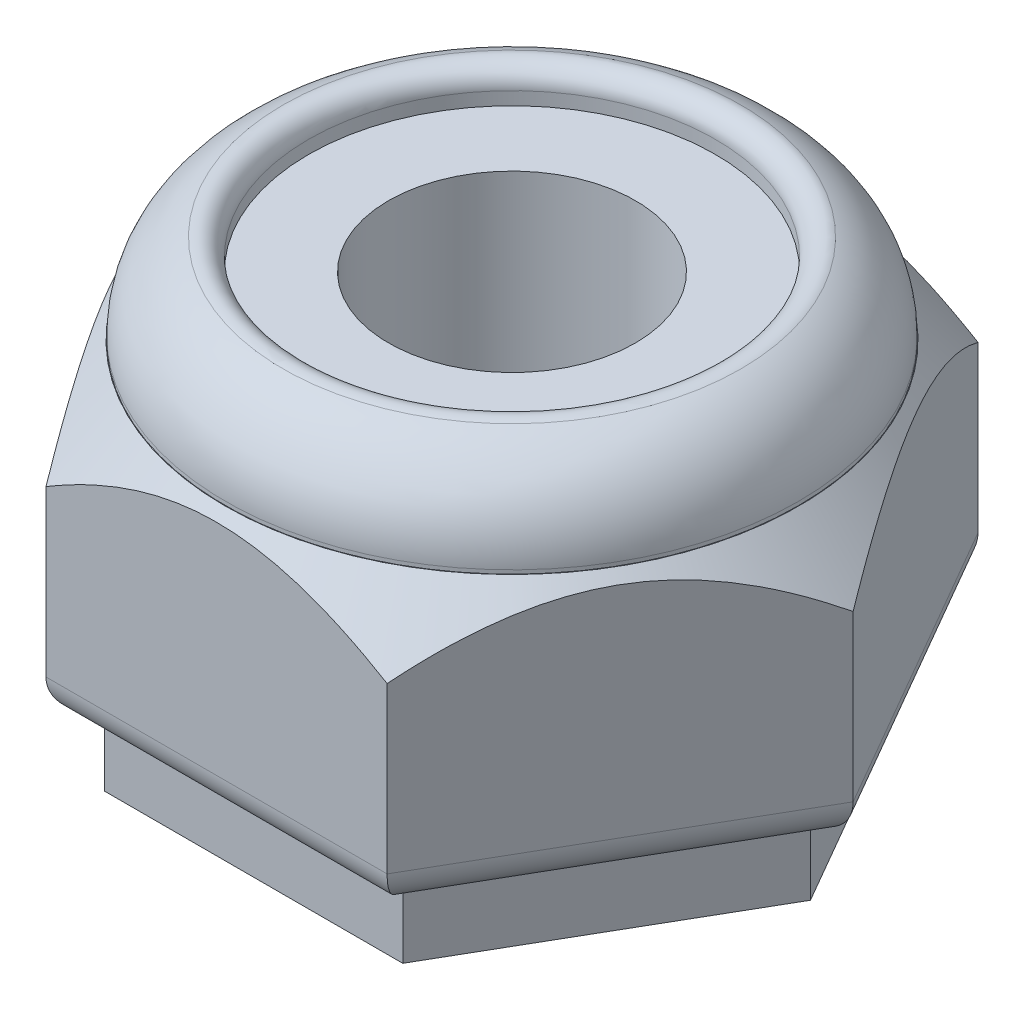
ISO-10303-21;
HEADER;
FILE_DESCRIPTION(('STEP AP214'),'2;1');
FILE_NAME('part.step','',(''),(''),'','','');
FILE_SCHEMA(('AUTOMOTIVE_DESIGN { 1 0 10303 214 1 1 1 1 }'));
ENDSEC;
DATA;
#1=APPLICATION_CONTEXT('core data for automotive mechanical design processes');
#2=APPLICATION_PROTOCOL_DEFINITION('international standard','automotive_design',2000,#1);
#3=PRODUCT_CONTEXT('',#1,'mechanical');
#4=PRODUCT('Part','Part','',(#3));
#5=PRODUCT_RELATED_PRODUCT_CATEGORY('part','',(#4));
#6=PRODUCT_DEFINITION_FORMATION('','',#4);
#7=PRODUCT_DEFINITION_CONTEXT('part definition',#1,'design');
#8=PRODUCT_DEFINITION('design','',#6,#7);
#9=PRODUCT_DEFINITION_SHAPE('','',#8);
#10=(LENGTH_UNIT() NAMED_UNIT(*) SI_UNIT(.MILLI.,.METRE.));
#11=(NAMED_UNIT(*) PLANE_ANGLE_UNIT() SI_UNIT($,.RADIAN.));
#12=(NAMED_UNIT(*) SI_UNIT($,.STERADIAN.) SOLID_ANGLE_UNIT());
#13=UNCERTAINTY_MEASURE_WITH_UNIT(LENGTH_MEASURE(1.E-05),#10,'distance_accuracy_value','');
#14=(GEOMETRIC_REPRESENTATION_CONTEXT(3) GLOBAL_UNCERTAINTY_ASSIGNED_CONTEXT((#13)) GLOBAL_UNIT_ASSIGNED_CONTEXT((#10,
#11,#12)) REPRESENTATION_CONTEXT('',''));
#15=CARTESIAN_POINT('',(0.,0.,0.));
#16=DIRECTION('',(0.,0.,1.));
#17=DIRECTION('',(1.,0.,0.));
#18=AXIS2_PLACEMENT_3D('',#15,#16,#17);
#19=CARTESIAN_POINT('',(0.,4.97840000000001,0.));
#20=DIRECTION('',(0.,-1.,0.));
#21=DIRECTION('',(1.,0.,0.));
#22=AXIS2_PLACEMENT_3D('',#19,#20,#21);
#23=CYLINDRICAL_SURFACE('',#22,3.93700000000001);
#24=CARTESIAN_POINT('',(0.,3.7084,0.));
#25=DIRECTION('',(0.,1.,0.));
#26=DIRECTION('',(-1.,0.,0.));
#27=AXIS2_PLACEMENT_3D('',#24,#25,#26);
#28=CIRCLE('',#27,3.937);
#29=CARTESIAN_POINT('',(-3.937,3.7084,0.));
#30=VERTEX_POINT('',#29);
#31=EDGE_CURVE('E143',#30,#30,#28,.T.);
#32=ORIENTED_EDGE('',*,*,#31,.F.);
#33=EDGE_LOOP('',(#32));
#34=FACE_BOUND('',#33,.T.);
#35=CARTESIAN_POINT('',(0.,3.6576,0.));
#36=DIRECTION('',(0.,-1.,0.));
#37=DIRECTION('',(1.,0.,0.));
#38=AXIS2_PLACEMENT_3D('',#35,#36,#37);
#39=CIRCLE('',#38,3.93700000000001);
#40=CARTESIAN_POINT('',(3.93700000000001,3.6576,0.));
#41=VERTEX_POINT('',#40);
#42=EDGE_CURVE('E21',#41,#41,#39,.F.);
#43=ORIENTED_EDGE('',*,*,#42,.T.);
#44=EDGE_LOOP('',(#43));
#45=FACE_BOUND('',#44,.T.);
#46=ADVANCED_FACE('F17',(#34,#45),#23,.T.);
#47=CARTESIAN_POINT('',(2.34315000000001,3.6576,4.05845484975502));
#48=DIRECTION('',(0.,-1.,0.));
#49=DIRECTION('',(1.,0.,0.));
#50=AXIS2_PLACEMENT_3D('',#47,#48,#49);
#51=PLANE('',#50);
#52=CARTESIAN_POINT('',(0.,3.65760000016735,0.));
#53=DIRECTION('',(0.,-1.,0.));
#54=DIRECTION('',(0.,0.,-1.));
#55=AXIS2_PLACEMENT_3D('',#52,#53,#54);
#56=CIRCLE('',#55,3.94407100938664);
#57=CARTESIAN_POINT('',(0.,3.65760000016735,-3.94407100938664));
#58=VERTEX_POINT('',#57);
#59=EDGE_CURVE('E142',#58,#58,#56,.T.);
#60=ORIENTED_EDGE('',*,*,#59,.F.);
#61=EDGE_LOOP('',(#60));
#62=FACE_BOUND('',#61,.T.);
#63=ORIENTED_EDGE('',*,*,#42,.F.);
#64=EDGE_LOOP('',(#63));
#65=FACE_BOUND('',#64,.T.);
#66=ADVANCED_FACE('F199',(#62,#65),#51,.F.);
#67=CARTESIAN_POINT('',(0.,3.70840000000008,0.));
#68=DIRECTION('',(0.,1.,0.));
#69=DIRECTION('',(0.,0.,1.));
#70=AXIS2_PLACEMENT_3D('',#67,#68,#69);
#71=TOROIDAL_SURFACE('',#70,2.66699999999999,1.27000000000001);
#72=ORIENTED_EDGE('',*,*,#31,.T.);
#73=EDGE_LOOP('',(#72));
#74=FACE_BOUND('',#73,.T.);
#75=CARTESIAN_POINT('',(0.,4.88572150982652,0.));
#76=DIRECTION('',(0.,1.,0.));
#77=DIRECTION('',(-1.,0.,0.));
#78=AXIS2_PLACEMENT_3D('',#75,#76,#77);
#79=CIRCLE('',#78,3.14325000000004);
#80=CARTESIAN_POINT('',(-3.14325000000003,4.88572150982652,0.));
#81=VERTEX_POINT('',#80);
#82=EDGE_CURVE('E122',#81,#81,#79,.T.);
#83=ORIENTED_EDGE('',*,*,#82,.F.);
#84=EDGE_LOOP('',(#83));
#85=FACE_BOUND('',#84,.T.);
#86=ADVANCED_FACE('F196',(#74,#85),#71,.T.);
#87=CARTESIAN_POINT('',(0.,2.76773860986168,0.));
#88=DIRECTION('',(0.,-1.,0.));
#89=DIRECTION('',(0.,0.,-1.));
#90=AXIS2_PLACEMENT_3D('',#87,#88,#89);
#91=CONICAL_SURFACE('',#90,4.69075337383629,0.698131700827581);
#92=CARTESIAN_POINT('',(-4.68630000002063,2.77304593408968,-5.5851817155357E-11));
#93=CARTESIAN_POINT('',(-4.65177717141987,2.81418235899122,0.0597952931143583));
#94=CARTESIAN_POINT('',(-4.61695780288894,2.85432113120693,0.120104208502788));
#95=CARTESIAN_POINT('',(-4.54666264441,2.93230661030783,0.241858994518482));
#96=CARTESIAN_POINT('',(-4.51118655193937,2.9701522247184,0.303305389130307));
#97=CARTESIAN_POINT('',(-4.40329561884235,3.0801870150985,0.490177966928205));
#98=CARTESIAN_POINT('',(-4.32983334003035,3.14837015585763,0.617418366271436));
#99=CARTESIAN_POINT('',(-4.17977964995295,3.27092778618679,0.877318981349457));
#100=CARTESIAN_POINT('',(-4.10317943930135,3.32525984895606,1.00999443806823));
#101=CARTESIAN_POINT('',(-3.94747591648453,3.41577217654512,1.2796808505042));
#102=CARTESIAN_POINT('',(-3.86837998240626,3.45200143021415,1.41667902699998));
#103=CARTESIAN_POINT('',(-3.73746585192525,3.49372811251008,1.64342895242181));
#104=CARTESIAN_POINT('',(-3.68614686015525,3.50560413722607,1.73231605356066));
#105=CARTESIAN_POINT('',(-3.58316406703978,3.52008140709636,1.910687483542));
#106=CARTESIAN_POINT('',(-3.53150020829175,3.52268106759616,2.00017191180866));
#107=CARTESIAN_POINT('',(-3.4285503454563,3.51847006530652,2.1784863048719));
#108=CARTESIAN_POINT('',(-3.37726380879505,3.51171021123823,2.26731719211343));
#109=CARTESIAN_POINT('',(-3.27519197702569,3.48921023560211,2.44411079075957));
#110=CARTESIAN_POINT('',(-3.224406707084,3.47346966546141,2.53207345857468));
#111=CARTESIAN_POINT('',(-3.10963060126893,3.42817062225528,2.73087150534129));
#112=CARTESIAN_POINT('',(-3.04589899568911,3.39598542078789,2.84125788425347));
#113=CARTESIAN_POINT('',(-2.92018166730183,3.32004827847368,3.05900668441208));
#114=CARTESIAN_POINT('',(-2.85819691952129,3.27629001415344,3.16636741686231));
#115=CARTESIAN_POINT('',(-2.7358890681865,3.1791036138555,3.37821082953874));
#116=CARTESIAN_POINT('',(-2.67557364726428,3.12563730729643,3.48268020305593));
#117=CARTESIAN_POINT('',(-2.55683004307658,3.01104764605198,3.68835015858288));
#118=CARTESIAN_POINT('',(-2.49840123076285,2.94992687744367,3.78955183013616));
#119=CARTESIAN_POINT('',(-2.42439626080902,2.86741854621722,3.91773219810881));
#120=CARTESIAN_POINT('',(-2.40802320097242,2.84883596647861,3.94609116962116));
#121=CARTESIAN_POINT('',(-2.3754621575828,2.81125673911825,4.00248855111944));
#122=CARTESIAN_POINT('',(-2.35927376439136,2.7922615116873,4.03052767061991));
#123=CARTESIAN_POINT('',(-2.34314999996957,2.77304593409365,4.05845484980773));
#124=B_SPLINE_CURVE_WITH_KNOTS('',3,(#92,#93,#94,#95,#96,#97,#98,#99,#100,#101,#102,#103,#104,
#105,#106,#107,#108,#109,#110,#111,#112,#113,#114,#115,#116,#117,#118,#119,#120,#121,#122,#123),
.UNSPECIFIED.,.F.,.F.,(4,2,2,2,2,2,2,2,2,2,2,2,2,2,2,4),(0.,0.241096809096306,0.482307589468028,
0.967637153878541,1.45443592247298,1.93991010962832,2.24950193441283,2.55914664334294,
2.86711700082692,3.17510274230014,3.56882084728694,3.96275452424868,4.35827201956431,
4.75365624709085,4.86660838996671,4.97921936903169),.UNSPECIFIED.);
#125=CARTESIAN_POINT('',(-4.68630000003129,2.77304593409263,1.36258849487727E-12));
#126=VERTEX_POINT('',#125);
#127=CARTESIAN_POINT('',(-2.34314999998476,2.77304593411176,4.05845484978141));
#128=VERTEX_POINT('',#127);
#129=EDGE_CURVE('E108',#126,#128,#124,.T.);
#130=ORIENTED_EDGE('',*,*,#129,.T.);
#131=CARTESIAN_POINT('',(-2.34315000006155,2.77304593408735,4.0584548497437));
#132=CARTESIAN_POINT('',(-2.27415972170866,2.81414935281164,4.05845484975083));
#133=CARTESIAN_POINT('',(-2.20457738522182,2.85425669894478,4.05845484975385));
#134=CARTESIAN_POINT('',(-2.06410193527611,2.93218331977878,4.05845484975614));
#135=CARTESIAN_POINT('',(-1.99320821640363,2.9700015014107,4.05845484975539));
#136=CARTESIAN_POINT('',(-1.77754688770714,3.07999086395974,4.05845484975419));
#137=CARTESIAN_POINT('',(-1.63068545867608,3.14815894046428,4.05845484975478));
#138=CARTESIAN_POINT('',(-1.3305275245436,3.27077676928304,4.05845484975521));
#139=CARTESIAN_POINT('',(-1.17720631605115,3.32516696813021,4.05845484975505));
#140=CARTESIAN_POINT('',(-0.86561350375334,3.41574608774384,4.05845484975494));
#141=CARTESIAN_POINT('',(-0.707359229251527,3.45199244882939,4.05845484975499));
#142=CARTESIAN_POINT('',(-0.456822143289689,3.49192146554132,4.058454849755));
#143=CARTESIAN_POINT('',(-0.365672921111748,3.50290887302486,4.058454849755));
#144=CARTESIAN_POINT('',(-0.183016321982132,3.51758027920227,4.058454849755));
#145=CARTESIAN_POINT('',(-0.0915105175139071,3.52128341043631,4.058454849755));
#146=CARTESIAN_POINT('',(0.104649468639837,3.52128177498356,4.058454849755));
#147=CARTESIAN_POINT('',(0.209305100868819,3.51643705340132,4.058454849755));
#148=CARTESIAN_POINT('',(0.417787181903716,3.49730239566766,4.058454849755));
#149=CARTESIAN_POINT('',(0.521613181345373,3.48300765118378,4.058454849755));
#150=CARTESIAN_POINT('',(0.728332544903489,3.44553375893286,4.058454849755));
#151=CARTESIAN_POINT('',(0.831215331547278,3.4222969773141,4.058454849755));
#152=CARTESIAN_POINT('',(1.03487580389782,3.36791830062304,4.058454849755));
#153=CARTESIAN_POINT('',(1.13565289467374,3.33677420329568,4.058454849755));
#154=CARTESIAN_POINT('',(1.33273383820815,3.26838741926302,4.058454849755));
#155=CARTESIAN_POINT('',(1.42908716224858,3.23128582693013,4.058454849755));
#156=CARTESIAN_POINT('',(1.61947291707491,3.15151071600647,4.058454849755));
#157=CARTESIAN_POINT('',(1.71350470709176,3.10883567908223,4.058454849755));
#158=CARTESIAN_POINT('',(1.89803195382149,3.01941532340772,4.058454849755));
#159=CARTESIAN_POINT('',(1.98855798046384,2.9727325573531,4.058454849755));
#160=CARTESIAN_POINT('',(2.16742834958516,2.87556944094008,4.058454849755));
#161=CARTESIAN_POINT('',(2.25577492893011,2.8250932194195,4.058454849755));
#162=CARTESIAN_POINT('',(2.34315000006327,2.77304593409223,4.058454849755));
#163=B_SPLINE_CURVE_WITH_KNOTS('',3,(#131,#132,#133,#134,#135,#136,#137,#138,#139,#140,#141,
#142,#143,#144,#145,#146,#147,#148,#149,#150,#151,#152,#153,#154,#155,#156,#157,#158,#159,#160,
#161,#162),.UNSPECIFIED.,.F.,.F.,(4,2,2,2,2,2,2,2,2,2,2,2,2,2,2,4),(0.,0.240903303567016,
0.481920744751272,0.967059466998938,1.45426068379578,1.93990959183257,2.21507934698528,
2.48952538388813,2.80337599595386,3.11738642358903,3.43345557970446,3.74961286053018,
4.05916118105052,4.36879400618447,4.67425708544416,4.97939238066899),.UNSPECIFIED.);
#164=CARTESIAN_POINT('',(2.34315000001685,2.77304593409264,4.05845484978141));
#165=VERTEX_POINT('',#164);
#166=EDGE_CURVE('E176',#128,#165,#163,.T.);
#167=ORIENTED_EDGE('',*,*,#166,.T.);
#168=CARTESIAN_POINT('',(2.34314999996197,2.77304593408969,4.05845484980079));
#169=CARTESIAN_POINT('',(2.37767282857373,2.81418235899124,3.99865955663693));
#170=CARTESIAN_POINT('',(2.41249219710932,2.85432113120694,3.93835064125119));
#171=CARTESIAN_POINT('',(2.48278735559178,2.93230661030784,3.81659585523753));
#172=CARTESIAN_POINT('',(2.51826344806127,2.97015222471841,3.75514946062505));
#173=CARTESIAN_POINT('',(2.62615438115643,3.0801870150985,3.56827688282608));
#174=CARTESIAN_POINT('',(2.69961665996934,3.14837015585764,3.44103648348338));
#175=CARTESIAN_POINT('',(2.8496703500474,3.27092778618679,3.18113586840574));
#176=CARTESIAN_POINT('',(2.92627056069876,3.32525984895606,3.04846041168683));
#177=CARTESIAN_POINT('',(3.08197408351539,3.41577217654512,2.77877399925076));
#178=CARTESIAN_POINT('',(3.16107001759374,3.45200143021415,2.64177582275502));
#179=CARTESIAN_POINT('',(3.29198414807477,3.49372811251008,2.4150258973332));
#180=CARTESIAN_POINT('',(3.34330313984477,3.50560413722607,2.32613879619435));
#181=CARTESIAN_POINT('',(3.44628593296023,3.52008140709636,2.147767366213));
#182=CARTESIAN_POINT('',(3.49794979170827,3.52268106759615,2.05828293794635));
#183=CARTESIAN_POINT('',(3.60089965454371,3.51847006530651,1.87996854488311));
#184=CARTESIAN_POINT('',(3.65218619120497,3.51171021123823,1.79113765764158));
#185=CARTESIAN_POINT('',(3.75425802297432,3.48921023560211,1.61434405899544));
#186=CARTESIAN_POINT('',(3.80504329291601,3.47346966546141,1.52638139118033));
#187=CARTESIAN_POINT('',(3.91981939873108,3.42817062225528,1.32758334441373));
#188=CARTESIAN_POINT('',(3.98355100431089,3.39598542078789,1.21719696550155));
#189=CARTESIAN_POINT('',(4.10926833269818,3.32004827847368,0.999448165342945));
#190=CARTESIAN_POINT('',(4.17125308047872,3.27629001415344,0.892087432892712));
#191=CARTESIAN_POINT('',(4.2935609318135,3.17910361385551,0.680244020216284));
#192=CARTESIAN_POINT('',(4.35387635273573,3.12563730729643,0.575774646699087));
#193=CARTESIAN_POINT('',(4.47261995692343,3.01104764605197,0.370104691172138));
#194=CARTESIAN_POINT('',(4.53104876923716,2.94992687744367,0.268903019618855));
#195=CARTESIAN_POINT('',(4.60505373919152,2.86741854621663,0.14072265164529));
#196=CARTESIAN_POINT('',(4.62142679902863,2.84883596647742,0.112363680132042));
#197=CARTESIAN_POINT('',(4.65398784241929,2.81125673911583,0.055966298631973));
#198=CARTESIAN_POINT('',(4.67017623561123,2.79226151168425,0.0279271791306273));
#199=CARTESIAN_POINT('',(4.68630000003353,2.77304593408996,-5.80666998558344E-11));
#200=B_SPLINE_CURVE_WITH_KNOTS('',3,(#168,#169,#170,#171,#172,#173,#174,#175,#176,#177,#178,
#179,#180,#181,#182,#183,#184,#185,#186,#187,#188,#189,#190,#191,#192,#193,#194,#195,#196,#197,
#198,#199),.UNSPECIFIED.,.F.,.F.,(4,2,2,2,2,2,2,2,2,2,2,2,2,2,2,4),(0.,0.241096809096303,
0.482307589468021,0.967637153878527,1.45443592247296,1.9399101096283,2.24950193441281,
2.55914664334292,2.8671170008269,3.17510274230012,3.56882084728691,3.96275452424864,
4.35827201956428,4.75365624709083,4.86660838997029,4.97921936903886),.UNSPECIFIED.);
#201=CARTESIAN_POINT('',(4.68630000002732,2.77304593409736,-1.0917840877275E-11));
#202=VERTEX_POINT('',#201);
#203=EDGE_CURVE('E183',#165,#202,#200,.T.);
#204=ORIENTED_EDGE('',*,*,#203,.T.);
#205=CARTESIAN_POINT('',(4.68630000001692,2.77304593410323,3.76267458844408E-11));
#206=CARTESIAN_POINT('',(4.65177717141278,2.8141823590028,-0.0597952931310414));
#207=CARTESIAN_POINT('',(4.61695780288054,2.85432113121737,-0.120104208518577));
#208=CARTESIAN_POINT('',(4.54666264440093,2.93230661031677,-0.241858994533079));
#209=CARTESIAN_POINT('',(4.51118655193091,2.97015222472698,-0.303305389144605));
#210=CARTESIAN_POINT('',(4.40329561883524,3.08018701510582,-0.490177966941427));
#211=CARTESIAN_POINT('',(4.32983334002344,3.14837015586387,-0.617418366283689));
#212=CARTESIAN_POINT('',(4.17977964994688,3.27092778619112,-0.877318981359809));
#213=CARTESIAN_POINT('',(4.10317943929591,3.32525984895958,-1.00999443807765));
#214=CARTESIAN_POINT('',(3.94747591648032,3.41577217654717,-1.27968085051162));
#215=CARTESIAN_POINT('',(3.86837998240263,3.45200143021556,-1.41667902700633));
#216=CARTESIAN_POINT('',(3.73746585192226,3.49372811251083,-1.64342895242706));
#217=CARTESIAN_POINT('',(3.68614686015226,3.50560413722664,-1.7323160535659));
#218=CARTESIAN_POINT('',(3.58316406703681,3.52008140709656,-1.91068748354721));
#219=CARTESIAN_POINT('',(3.53150020828879,3.52268106759618,-2.00017191181384));
#220=CARTESIAN_POINT('',(3.42855034545338,3.51847006530618,-2.17848630487702));
#221=CARTESIAN_POINT('',(3.37726380879215,3.51171021123772,-2.26731719211852));
#222=CARTESIAN_POINT('',(3.27519197702284,3.48921023560127,-2.44411079076458));
#223=CARTESIAN_POINT('',(3.22440670708118,3.47346966546041,-2.53207345857964));
#224=CARTESIAN_POINT('',(3.10963060126602,3.42817062225387,-2.73087150534641));
#225=CARTESIAN_POINT('',(3.04589899568608,3.39598542078622,-2.84125788425879));
#226=CARTESIAN_POINT('',(2.92018166729857,3.32004827847145,-3.05900668441778));
#227=CARTESIAN_POINT('',(2.85819691951793,3.27629001415092,-3.1663674168682));
#228=CARTESIAN_POINT('',(2.73588906818295,3.17910361385241,-3.37821082954497));
#229=CARTESIAN_POINT('',(2.67557364726063,3.12563730729304,-3.48268020306233));
#230=CARTESIAN_POINT('',(2.55683004307275,3.01104764604801,-3.68835015858959));
#231=CARTESIAN_POINT('',(2.49840123075893,2.94992687743942,-3.78955183014302));
#232=CARTESIAN_POINT('',(2.42439626080543,2.8674185462131,-3.91773219811509));
#233=CARTESIAN_POINT('',(2.40802320096925,2.84883596647492,-3.94609116962672));
#234=CARTESIAN_POINT('',(2.37546215758045,2.81125673911543,-4.00248855112358));
#235=CARTESIAN_POINT('',(2.35927376438942,2.79226151168493,-4.03052767062335));
#236=CARTESIAN_POINT('',(2.34314999996803,2.77304593409174,-4.05845484981047));
#237=B_SPLINE_CURVE_WITH_KNOTS('',3,(#205,#206,#207,#208,#209,#210,#211,#212,#213,#214,#215,
#216,#217,#218,#219,#220,#221,#222,#223,#224,#225,#226,#227,#228,#229,#230,#231,#232,#233,#234,
#235,#236),.UNSPECIFIED.,.F.,.F.,(4,2,2,2,2,2,2,2,2,2,2,2,2,2,2,4),(0.,0.241096809094276,
0.482307589464009,0.967637153870556,1.45443592246103,1.93991010961239,2.2495019343968,
2.55914664332681,2.86711700081071,3.17510274228384,3.56882084727151,3.96275452423413,
4.35827201955063,4.75365624707804,4.86660838995109,4.97921936901329),.UNSPECIFIED.);
#238=CARTESIAN_POINT('',(2.34315000001448,2.77304593409259,-4.05845484978282));
#239=VERTEX_POINT('',#238);
#240=EDGE_CURVE('E203',#202,#239,#237,.T.);
#241=ORIENTED_EDGE('',*,*,#240,.T.);
#242=CARTESIAN_POINT('',(2.34315000005868,2.77304593408962,-4.058454849745));
#243=CARTESIAN_POINT('',(2.2741597217057,2.81414935281353,-4.05845484975135));
#244=CARTESIAN_POINT('',(2.20457738521886,2.85425669894645,-4.05845484975405));
#245=CARTESIAN_POINT('',(2.06410193527325,2.93218331978018,-4.05845484975609));
#246=CARTESIAN_POINT('',(1.99320821640086,2.97000150141205,-4.05845484975542));
#247=CARTESIAN_POINT('',(1.77754688770464,3.07999086396089,-4.05845484975435));
#248=CARTESIAN_POINT('',(1.63068545867372,3.14815894046526,-4.05845484975488));
#249=CARTESIAN_POINT('',(1.33052752454156,3.2707767692837,-4.05845484975526));
#250=CARTESIAN_POINT('',(1.17720631604929,3.32516696813074,-4.05845484975512));
#251=CARTESIAN_POINT('',(0.865613503751842,3.41574608774412,-4.05845484975502));
#252=CARTESIAN_POINT('',(0.707359229250219,3.45199244882957,-4.05845484975506));
#253=CARTESIAN_POINT('',(0.456822143288761,3.49192146554135,-4.05845484975507));
#254=CARTESIAN_POINT('',(0.365672921111005,3.50290887302485,-4.05845484975507));
#255=CARTESIAN_POINT('',(0.183016321981762,3.5175802792022,-4.05845484975507));
#256=CARTESIAN_POINT('',(0.0915105175137235,3.52128341043623,-4.05845484975507));
#257=CARTESIAN_POINT('',(-0.104649468639836,3.52128177498348,-4.05845484975507));
#258=CARTESIAN_POINT('',(-0.209305100868819,3.51643705340124,-4.05845484975507));
#259=CARTESIAN_POINT('',(-0.41778718190372,3.49730239566758,-4.05845484975507));
#260=CARTESIAN_POINT('',(-0.521613181345379,3.48300765118369,-4.05845484975507));
#261=CARTESIAN_POINT('',(-0.728332544903499,3.44553375893278,-4.05845484975507));
#262=CARTESIAN_POINT('',(-0.831215331547289,3.42229697731402,-4.05845484975507));
#263=CARTESIAN_POINT('',(-1.03487580389784,3.36791830062295,-4.05845484975507));
#264=CARTESIAN_POINT('',(-1.13565289467376,3.3367742032956,-4.05845484975507));
#265=CARTESIAN_POINT('',(-1.33273383820816,3.26838741926293,-4.05845484975507));
#266=CARTESIAN_POINT('',(-1.42908716224858,3.23128582693005,-4.05845484975507));
#267=CARTESIAN_POINT('',(-1.61947291707489,3.1515107160064,-4.05845484975507));
#268=CARTESIAN_POINT('',(-1.71350470709174,3.10883567908216,-4.05845484975507));
#269=CARTESIAN_POINT('',(-1.89803195382145,3.01941532340766,-4.05845484975507));
#270=CARTESIAN_POINT('',(-1.9885579804638,2.97273255735305,-4.05845484975507));
#271=CARTESIAN_POINT('',(-2.1674283495851,2.87556944094004,-4.05845484975507));
#272=CARTESIAN_POINT('',(-2.25577492893005,2.82509321941947,-4.05845484975507));
#273=CARTESIAN_POINT('',(-2.3431500000632,2.7730459340922,-4.05845484975507));
#274=B_SPLINE_CURVE_WITH_KNOTS('',3,(#242,#243,#244,#245,#246,#247,#248,#249,#250,#251,#252,
#253,#254,#255,#256,#257,#258,#259,#260,#261,#262,#263,#264,#265,#266,#267,#268,#269,#270,#271,
#272,#273),.UNSPECIFIED.,.F.,.F.,(4,2,2,2,2,2,2,2,2,2,2,2,2,2,2,4),(0.,0.240903303566687,
0.481920744750623,0.967059466997657,1.45426068379387,1.93990959183004,2.21507934698218,
2.48952538388447,2.80337599595021,3.11738642358539,3.43345557970082,3.74961286052654,
4.05916118104685,4.36879400618078,4.67425708544044,4.97939238066524),.UNSPECIFIED.);
#275=CARTESIAN_POINT('',(-2.34315000001679,2.77304593409261,-4.05845484978147));
#276=VERTEX_POINT('',#275);
#277=EDGE_CURVE('E111',#239,#276,#274,.T.);
#278=ORIENTED_EDGE('',*,*,#277,.T.);
#279=CARTESIAN_POINT('',(-2.34314999996192,2.77304593408966,-4.05845484980084));
#280=CARTESIAN_POINT('',(-2.37767282857368,2.81418235899121,-3.99865955663698));
#281=CARTESIAN_POINT('',(-2.41249219710928,2.85432113120691,-3.93835064125125));
#282=CARTESIAN_POINT('',(-2.48278735559174,2.93230661030781,-3.81659585523759));
#283=CARTESIAN_POINT('',(-2.51826344806123,2.97015222471838,-3.7551494606251));
#284=CARTESIAN_POINT('',(-2.62615438115639,3.08018701509849,-3.56827688282613));
#285=CARTESIAN_POINT('',(-2.6996166599693,3.14837015585762,-3.44103648348342));
#286=CARTESIAN_POINT('',(-2.84967035004737,3.27092778618678,-3.18113586840577));
#287=CARTESIAN_POINT('',(-2.92627056069873,3.32525984895606,-3.04846041168686));
#288=CARTESIAN_POINT('',(-3.08197408351537,3.41577217654512,-2.77877399925078));
#289=CARTESIAN_POINT('',(-3.16107001759372,3.45200143021415,-2.64177582275504));
#290=CARTESIAN_POINT('',(-3.29198414807476,3.49372811251009,-2.41502589733322));
#291=CARTESIAN_POINT('',(-3.34330313984475,3.50560413722608,-2.32613879619437));
#292=CARTESIAN_POINT('',(-3.44628593296022,3.52008140709636,-2.14776736621302));
#293=CARTESIAN_POINT('',(-3.49794979170825,3.52268106759616,-2.05828293794636));
#294=CARTESIAN_POINT('',(-3.6008996545437,3.51847006530652,-1.87996854488312));
#295=CARTESIAN_POINT('',(-3.65218619120495,3.51171021123824,-1.79113765764159));
#296=CARTESIAN_POINT('',(-3.7542580229743,3.48921023560212,-1.61434405899545));
#297=CARTESIAN_POINT('',(-3.80504329291599,3.47346966546142,-1.52638139118034));
#298=CARTESIAN_POINT('',(-3.91981939873106,3.42817062225528,-1.32758334441374));
#299=CARTESIAN_POINT('',(-3.98355100431088,3.3959854207879,-1.21719696550156));
#300=CARTESIAN_POINT('',(-4.10926833269817,3.32004827847369,-0.999448165342954));
#301=CARTESIAN_POINT('',(-4.1712530804787,3.27629001415345,-0.89208743289272));
#302=CARTESIAN_POINT('',(-4.29356093181349,3.17910361385552,-0.680244020216292));
#303=CARTESIAN_POINT('',(-4.35387635273571,3.12563730729644,-0.575774646699097));
#304=CARTESIAN_POINT('',(-4.47261995692341,3.01104764605199,-0.370104691172152));
#305=CARTESIAN_POINT('',(-4.53104876923714,2.94992687744368,-0.26890301961887));
#306=CARTESIAN_POINT('',(-4.60505373919125,2.86741854621693,-0.14072265164575));
#307=CARTESIAN_POINT('',(-4.62142679902811,2.84883596647801,-0.112363680132942));
#308=CARTESIAN_POINT('',(-4.65398784241826,2.81125673911702,-0.0559662986337416));
#309=CARTESIAN_POINT('',(-4.67017623560996,2.79226151168575,-0.0279271791328252));
#310=CARTESIAN_POINT('',(-4.68630000003201,2.77304593409177,5.54427484235605E-11));
#311=B_SPLINE_CURVE_WITH_KNOTS('',3,(#279,#280,#281,#282,#283,#284,#285,#286,#287,#288,#289,
#290,#291,#292,#293,#294,#295,#296,#297,#298,#299,#300,#301,#302,#303,#304,#305,#306,#307,#308,
#309,#310),.UNSPECIFIED.,.F.,.F.,(4,2,2,2,2,2,2,2,2,2,2,2,2,2,2,4),(0.,0.24109680909631,
0.482307589468037,0.967637153878559,1.45443592247301,1.93991010962836,2.24950193441287,
2.55914664334298,2.86711700082697,3.17510274230018,3.56882084728698,3.96275452424871,
4.35827201956434,4.75365624709089,4.86660838996859,4.97921936903541),.UNSPECIFIED.);
#312=EDGE_CURVE('E104',#276,#126,#311,.T.);
#313=ORIENTED_EDGE('',*,*,#312,.T.);
#314=EDGE_LOOP('',(#130,#167,#204,#241,#278,#313));
#315=FACE_BOUND('',#314,.T.);
#316=ORIENTED_EDGE('',*,*,#59,.T.);
#317=EDGE_LOOP('',(#316));
#318=FACE_BOUND('',#317,.T.);
#319=ADVANCED_FACE('F106',(#315,#318),#91,.T.);
#320=CARTESIAN_POINT('',(0.,4.65025720786122,0.));
#321=DIRECTION('',(0.,-1.,0.));
#322=DIRECTION('',(1.,0.,0.));
#323=AXIS2_PLACEMENT_3D('',#320,#321,#322);
#324=TOROIDAL_SURFACE('',#323,3.04800000000006,0.254);
#325=CARTESIAN_POINT('',(0.,4.65025720786115,0.));
#326=DIRECTION('',(0.,1.,0.));
#327=DIRECTION('',(-1.,0.,0.));
#328=AXIS2_PLACEMENT_3D('',#325,#326,#327);
#329=CIRCLE('',#328,2.79400000000001);
#330=CARTESIAN_POINT('',(-2.79400000000001,4.65025720786115,0.));
#331=VERTEX_POINT('',#330);
#332=EDGE_CURVE('E135',#331,#331,#329,.F.);
#333=ORIENTED_EDGE('',*,*,#332,.T.);
#334=EDGE_LOOP('',(#333));
#335=FACE_BOUND('',#334,.T.);
#336=ORIENTED_EDGE('',*,*,#82,.T.);
#337=EDGE_LOOP('',(#336));
#338=FACE_BOUND('',#337,.T.);
#339=ADVANCED_FACE('F19',(#335,#338),#324,.T.);
#340=CARTESIAN_POINT('',(-4.6863,3.6576,0.));
#341=DIRECTION('',(0.866025403784439,0.,-0.5));
#342=DIRECTION('',(-0.5,0.,-0.866025403784439));
#343=AXIS2_PLACEMENT_3D('',#340,#341,#342);
#344=PLANE('',#343);
#345=DIRECTION('',(0.,1.,0.));
#346=VECTOR('',#345,1.);
#347=CARTESIAN_POINT('',(-2.34315,3.6576,4.058454849755));
#348=LINE('',#347,#346);
#349=CARTESIAN_POINT('',(-2.34315000000001,0.507999999999995,4.05845484975499));
#350=VERTEX_POINT('',#349);
#351=EDGE_CURVE('E121',#350,#128,#348,.T.);
#352=ORIENTED_EDGE('',*,*,#351,.T.);
#353=ORIENTED_EDGE('',*,*,#129,.F.);
#354=DIRECTION('',(0.,1.,0.));
#355=VECTOR('',#354,1.);
#356=CARTESIAN_POINT('',(-4.6863000000071,3.6576,1.22922505507717E-11));
#357=LINE('',#356,#355);
#358=CARTESIAN_POINT('',(-4.68630000000355,0.507999999999995,6.14200530713038E-12));
#359=VERTEX_POINT('',#358);
#360=EDGE_CURVE('E115',#126,#359,#357,.F.);
#361=ORIENTED_EDGE('',*,*,#360,.T.);
#362=DIRECTION('',(-0.5,0.,-0.866025403784439));
#363=VECTOR('',#362,1.);
#364=CARTESIAN_POINT('',(-4.68630000000001,0.507999999999995,0.));
#365=LINE('',#364,#363);
#366=EDGE_CURVE('E138',#350,#359,#365,.T.);
#367=ORIENTED_EDGE('',*,*,#366,.F.);
#368=EDGE_LOOP('',(#352,#353,#361,#367));
#369=FACE_BOUND('',#368,.T.);
#370=ADVANCED_FACE('F118',(#369),#344,.F.);
#371=CARTESIAN_POINT('',(-2.34315,3.6576,-4.05845484975501));
#372=DIRECTION('',(0.866025403784439,0.,0.5));
#373=DIRECTION('',(0.5,0.,-0.866025403784439));
#374=AXIS2_PLACEMENT_3D('',#371,#372,#373);
#375=PLANE('',#374);
#376=ORIENTED_EDGE('',*,*,#360,.F.);
#377=ORIENTED_EDGE('',*,*,#312,.F.);
#378=DIRECTION('',(0.,1.,0.));
#379=VECTOR('',#378,1.);
#380=CARTESIAN_POINT('',(-2.34315000001417,3.6576,-4.05845484975507));
#381=LINE('',#380,#379);
#382=CARTESIAN_POINT('',(-2.34315000000708,0.507999999999994,-4.05845484975504));
#383=VERTEX_POINT('',#382);
#384=EDGE_CURVE('E130',#276,#383,#381,.F.);
#385=ORIENTED_EDGE('',*,*,#384,.T.);
#386=DIRECTION('',(0.5,0.,-0.866025403784439));
#387=VECTOR('',#386,1.);
#388=CARTESIAN_POINT('',(-2.34315,0.507999999999995,-4.05845484975502));
#389=LINE('',#388,#387);
#390=EDGE_CURVE('E127',#359,#383,#389,.T.);
#391=ORIENTED_EDGE('',*,*,#390,.F.);
#392=EDGE_LOOP('',(#376,#377,#385,#391));
#393=FACE_BOUND('',#392,.T.);
#394=ADVANCED_FACE('F125',(#393),#375,.F.);
#395=CARTESIAN_POINT('',(2.34315000000001,3.6576,-4.05845484975507));
#396=DIRECTION('',(0.,0.,1.));
#397=DIRECTION('',(1.,0.,0.));
#398=AXIS2_PLACEMENT_3D('',#395,#396,#397);
#399=PLANE('',#398);
#400=ORIENTED_EDGE('',*,*,#384,.F.);
#401=ORIENTED_EDGE('',*,*,#277,.F.);
#402=DIRECTION('',(0.,1.,0.));
#403=VECTOR('',#402,1.);
#404=CARTESIAN_POINT('',(2.34314999999293,3.6576,-4.05845484976733));
#405=LINE('',#404,#403);
#406=CARTESIAN_POINT('',(2.34314999999648,0.507999999999995,-4.05845484976118));
#407=VERTEX_POINT('',#406);
#408=EDGE_CURVE('E506',#239,#407,#405,.F.);
#409=ORIENTED_EDGE('',*,*,#408,.T.);
#410=DIRECTION('',(1.,0.,0.));
#411=VECTOR('',#410,1.);
#412=CARTESIAN_POINT('',(2.34315,0.507999999999994,-4.05845484975503));
#413=LINE('',#412,#411);
#414=EDGE_CURVE('E170',#383,#407,#413,.T.);
#415=ORIENTED_EDGE('',*,*,#414,.F.);
#416=EDGE_LOOP('',(#400,#401,#409,#415));
#417=FACE_BOUND('',#416,.T.);
#418=ADVANCED_FACE('F343',(#417),#399,.F.);
#419=CARTESIAN_POINT('',(4.68630000000002,3.6576,0.));
#420=DIRECTION('',(-0.866025403784439,0.,0.5));
#421=DIRECTION('',(0.5,0.,0.866025403784439));
#422=AXIS2_PLACEMENT_3D('',#419,#420,#421);
#423=PLANE('',#422);
#424=ORIENTED_EDGE('',*,*,#408,.F.);
#425=ORIENTED_EDGE('',*,*,#240,.F.);
#426=DIRECTION('',(0.,1.,0.));
#427=VECTOR('',#426,1.);
#428=CARTESIAN_POINT('',(4.68630000001422,3.6576,-2.46174608475869E-11));
#429=LINE('',#428,#427);
#430=CARTESIAN_POINT('',(4.68630000000712,0.508000000000008,-1.23196537606812E-11));
#431=VERTEX_POINT('',#430);
#432=EDGE_CURVE('E498',#202,#431,#429,.F.);
#433=ORIENTED_EDGE('',*,*,#432,.T.);
#434=DIRECTION('',(0.5,0.,0.866025403784439));
#435=VECTOR('',#434,1.);
#436=CARTESIAN_POINT('',(4.68630000000002,0.507999999999995,0.));
#437=LINE('',#436,#435);
#438=EDGE_CURVE('E166',#407,#431,#437,.T.);
#439=ORIENTED_EDGE('',*,*,#438,.F.);
#440=EDGE_LOOP('',(#424,#425,#433,#439));
#441=FACE_BOUND('',#440,.T.);
#442=ADVANCED_FACE('F349',(#441),#423,.F.);
#443=CARTESIAN_POINT('',(2.34315000000001,3.6576,4.05845484975502));
#444=DIRECTION('',(-0.866025403784439,0.,-0.499999999999999));
#445=DIRECTION('',(-0.499999999999999,0.,0.866025403784439));
#446=AXIS2_PLACEMENT_3D('',#443,#444,#445);
#447=PLANE('',#446);
#448=ORIENTED_EDGE('',*,*,#432,.F.);
#449=ORIENTED_EDGE('',*,*,#203,.F.);
#450=DIRECTION('',(0.,1.,0.));
#451=VECTOR('',#450,1.);
#452=CARTESIAN_POINT('',(2.34315000001423,3.6576,4.058454849755));
#453=LINE('',#452,#451);
#454=CARTESIAN_POINT('',(2.34315000000713,0.507999999999995,4.05845484975499));
#455=VERTEX_POINT('',#454);
#456=EDGE_CURVE('E139',#165,#455,#453,.F.);
#457=ORIENTED_EDGE('',*,*,#456,.T.);
#458=DIRECTION('',(-0.499999999999999,0.,0.866025403784439));
#459=VECTOR('',#458,1.);
#460=CARTESIAN_POINT('',(2.34315000000003,0.508000000000008,4.05845484975498));
#461=LINE('',#460,#459);
#462=EDGE_CURVE('E162',#431,#455,#461,.T.);
#463=ORIENTED_EDGE('',*,*,#462,.F.);
#464=EDGE_LOOP('',(#448,#449,#457,#463));
#465=FACE_BOUND('',#464,.T.);
#466=ADVANCED_FACE('F303',(#465),#447,.F.);
#467=CARTESIAN_POINT('',(-2.34315000000002,3.6576,4.058454849755));
#468=DIRECTION('',(0.,0.,-1.));
#469=DIRECTION('',(-1.,0.,0.));
#470=AXIS2_PLACEMENT_3D('',#467,#468,#469);
#471=PLANE('',#470);
#472=ORIENTED_EDGE('',*,*,#456,.F.);
#473=ORIENTED_EDGE('',*,*,#166,.F.);
#474=ORIENTED_EDGE('',*,*,#351,.F.);
#475=DIRECTION('',(-1.,0.,0.));
#476=VECTOR('',#475,1.);
#477=CARTESIAN_POINT('',(-2.34315,0.507999999999995,4.05845484975498));
#478=LINE('',#477,#476);
#479=EDGE_CURVE('E158',#455,#350,#478,.T.);
#480=ORIENTED_EDGE('',*,*,#479,.F.);
#481=EDGE_LOOP('',(#472,#473,#474,#480));
#482=FACE_BOUND('',#481,.T.);
#483=ADVANCED_FACE('F189',(#482),#471,.F.);
#484=CARTESIAN_POINT('',(0.,4.4704,0.));
#485=DIRECTION('',(0.,1.,0.));
#486=DIRECTION('',(-1.,0.,0.));
#487=AXIS2_PLACEMENT_3D('',#484,#485,#486);
#488=CYLINDRICAL_SURFACE('',#487,2.79400000000001);
#489=ORIENTED_EDGE('',*,*,#332,.F.);
#490=EDGE_LOOP('',(#489));
#491=FACE_BOUND('',#490,.T.);
#492=CARTESIAN_POINT('',(0.,4.4704,0.));
#493=DIRECTION('',(0.,1.,0.));
#494=DIRECTION('',(-1.,0.,0.));
#495=AXIS2_PLACEMENT_3D('',#492,#493,#494);
#496=CIRCLE('',#495,2.79400000000001);
#497=CARTESIAN_POINT('',(-2.79400000000001,4.4704,0.));
#498=VERTEX_POINT('',#497);
#499=EDGE_CURVE('E151',#498,#498,#496,.T.);
#500=ORIENTED_EDGE('',*,*,#499,.F.);
#501=EDGE_LOOP('',(#500));
#502=FACE_BOUND('',#501,.T.);
#503=ADVANCED_FACE('F296',(#491,#502),#488,.F.);
#504=CARTESIAN_POINT('',(-4.24635909487751,0.507999999999995,-0.254000000000011));
#505=DIRECTION('',(-0.5,0.,-0.866025403784439));
#506=DIRECTION('',(-0.866025403784439,0.,0.5));
#507=AXIS2_PLACEMENT_3D('',#504,#505,#506);
#508=CYLINDRICAL_SURFACE('',#507,0.508000000000002);
#509=CARTESIAN_POINT('',(-4.09971212650334,0.507999999999995,0.));
#510=DIRECTION('',(0.,0.,-1.));
#511=DIRECTION('',(1.,0.,0.));
#512=AXIS2_PLACEMENT_3D('',#509,#510,#511);
#513=ELLIPSE('',#512,0.586587873496662,0.508000000000002);
#514=CARTESIAN_POINT('',(-4.09971212650335,0.,0.));
#515=VERTEX_POINT('',#514);
#516=EDGE_CURVE('E174',#515,#359,#513,.T.);
#517=ORIENTED_EDGE('',*,*,#516,.F.);
#518=DIRECTION('',(-0.5,0.,-0.866025403784439));
#519=VECTOR('',#518,1.);
#520=CARTESIAN_POINT('',(-2.04985606325168,0.,3.55045484975499));
#521=LINE('',#520,#519);
#522=CARTESIAN_POINT('',(-2.04985606325168,0.,3.55045484975498));
#523=VERTEX_POINT('',#522);
#524=EDGE_CURVE('E154',#515,#523,#521,.F.);
#525=ORIENTED_EDGE('',*,*,#524,.T.);
#526=CARTESIAN_POINT('',(-2.04985606325169,0.507999999999995,3.55045484975498));
#527=DIRECTION('',(-0.866025403784438,0.,-0.5));
#528=DIRECTION('',(-0.5,0.,0.866025403784438));
#529=AXIS2_PLACEMENT_3D('',#526,#527,#528);
#530=ELLIPSE('',#529,0.586587873496662,0.508000000000002);
#531=EDGE_CURVE('E155',#350,#523,#530,.F.);
#532=ORIENTED_EDGE('',*,*,#531,.F.);
#533=ORIENTED_EDGE('',*,*,#366,.T.);
#534=EDGE_LOOP('',(#517,#525,#532,#533));
#535=FACE_BOUND('',#534,.T.);
#536=ADVANCED_FACE('F293',(#535),#508,.T.);
#537=CARTESIAN_POINT('',(-1.9032090948775,0.507999999999995,-3.80445484975502));
#538=DIRECTION('',(0.5,0.,-0.866025403784439));
#539=DIRECTION('',(-0.866025403784439,0.,-0.5));
#540=AXIS2_PLACEMENT_3D('',#537,#538,#539);
#541=CYLINDRICAL_SURFACE('',#540,0.508000000000002);
#542=CARTESIAN_POINT('',(-2.04985606325166,0.508000000000002,-3.55045484975503));
#543=DIRECTION('',(0.866025403784439,0.,-0.5));
#544=DIRECTION('',(0.5,0.,0.866025403784439));
#545=AXIS2_PLACEMENT_3D('',#542,#543,#544);
#546=ELLIPSE('',#545,0.586587873496661,0.508000000000002);
#547=CARTESIAN_POINT('',(-2.04985606325168,0.,-3.55045484975506));
#548=VERTEX_POINT('',#547);
#549=EDGE_CURVE('E171',#548,#383,#546,.T.);
#550=ORIENTED_EDGE('',*,*,#549,.F.);
#551=DIRECTION('',(0.5,0.,-0.866025403784439));
#552=VECTOR('',#551,1.);
#553=CARTESIAN_POINT('',(-4.09971212650335,0.,0.));
#554=LINE('',#553,#552);
#555=EDGE_CURVE('E528',#548,#515,#554,.F.);
#556=ORIENTED_EDGE('',*,*,#555,.T.);
#557=ORIENTED_EDGE('',*,*,#516,.T.);
#558=ORIENTED_EDGE('',*,*,#390,.T.);
#559=EDGE_LOOP('',(#550,#556,#557,#558));
#560=FACE_BOUND('',#559,.T.);
#561=ADVANCED_FACE('F289',(#560),#541,.T.);
#562=CARTESIAN_POINT('',(2.34315,0.508000000000008,-3.55045484975503));
#563=DIRECTION('',(1.,0.,0.));
#564=DIRECTION('',(0.,1.,0.));
#565=AXIS2_PLACEMENT_3D('',#562,#563,#564);
#566=CYLINDRICAL_SURFACE('',#565,0.508000000000002);
#567=CARTESIAN_POINT('',(2.04985606325169,0.508000000000002,-3.55045484975503));
#568=DIRECTION('',(0.866025403784438,0.,0.5));
#569=DIRECTION('',(-0.5,0.,0.866025403784439));
#570=AXIS2_PLACEMENT_3D('',#567,#568,#569);
#571=ELLIPSE('',#570,0.586587873496662,0.508000000000002);
#572=CARTESIAN_POINT('',(2.04985606325168,0.,-3.55045484975508));
#573=VERTEX_POINT('',#572);
#574=EDGE_CURVE('E167',#573,#407,#571,.T.);
#575=ORIENTED_EDGE('',*,*,#574,.F.);
#576=DIRECTION('',(1.,0.,0.));
#577=VECTOR('',#576,1.);
#578=CARTESIAN_POINT('',(-2.04985606325165,0.,-3.55045484975508));
#579=LINE('',#578,#577);
#580=EDGE_CURVE('E517',#573,#548,#579,.F.);
#581=ORIENTED_EDGE('',*,*,#580,.T.);
#582=ORIENTED_EDGE('',*,*,#549,.T.);
#583=ORIENTED_EDGE('',*,*,#414,.T.);
#584=EDGE_LOOP('',(#575,#581,#582,#583));
#585=FACE_BOUND('',#584,.T.);
#586=ADVANCED_FACE('F285',(#585),#566,.T.);
#587=CARTESIAN_POINT('',(4.24635909487753,0.507999999999995,0.253999999999983));
#588=DIRECTION('',(0.5,0.,0.866025403784439));
#589=DIRECTION('',(0.866025403784439,0.,-0.5));
#590=AXIS2_PLACEMENT_3D('',#587,#588,#589);
#591=CYLINDRICAL_SURFACE('',#590,0.508000000000002);
#592=ORIENTED_EDGE('',*,*,#574,.T.);
#593=ORIENTED_EDGE('',*,*,#438,.T.);
#594=CARTESIAN_POINT('',(4.09971212650336,0.508000000000002,0.));
#595=DIRECTION('',(0.,0.,1.));
#596=DIRECTION('',(-1.,0.,0.));
#597=AXIS2_PLACEMENT_3D('',#594,#595,#596);
#598=ELLIPSE('',#597,0.586587873496662,0.508000000000002);
#599=CARTESIAN_POINT('',(4.09971212650335,0.,0.));
#600=VERTEX_POINT('',#599);
#601=EDGE_CURVE('E163',#600,#431,#598,.T.);
#602=ORIENTED_EDGE('',*,*,#601,.F.);
#603=DIRECTION('',(0.5,0.,0.866025403784439));
#604=VECTOR('',#603,1.);
#605=CARTESIAN_POINT('',(2.04985606325167,0.,-3.55045484975502));
#606=LINE('',#605,#604);
#607=EDGE_CURVE('E581',#600,#573,#606,.F.);
#608=ORIENTED_EDGE('',*,*,#607,.T.);
#609=EDGE_LOOP('',(#592,#593,#602,#608));
#610=FACE_BOUND('',#609,.T.);
#611=ADVANCED_FACE('F281',(#610),#591,.T.);
#612=CARTESIAN_POINT('',(1.90320909487753,0.508000000000008,3.80445484975498));
#613=DIRECTION('',(-0.499999999999999,0.,0.866025403784439));
#614=DIRECTION('',(0.866025403784439,0.,0.499999999999999));
#615=AXIS2_PLACEMENT_3D('',#612,#613,#614);
#616=CYLINDRICAL_SURFACE('',#615,0.508000000000002);
#617=ORIENTED_EDGE('',*,*,#601,.T.);
#618=ORIENTED_EDGE('',*,*,#462,.T.);
#619=CARTESIAN_POINT('',(2.0498560632517,0.508000000000002,3.55045484975498));
#620=DIRECTION('',(-0.866025403784439,0.,0.5));
#621=DIRECTION('',(-0.5,0.,-0.866025403784439));
#622=AXIS2_PLACEMENT_3D('',#619,#620,#621);
#623=ELLIPSE('',#622,0.586587873496662,0.508000000000002);
#624=CARTESIAN_POINT('',(2.0498560632517,0.,3.55045484975498));
#625=VERTEX_POINT('',#624);
#626=EDGE_CURVE('E159',#625,#455,#623,.T.);
#627=ORIENTED_EDGE('',*,*,#626,.F.);
#628=DIRECTION('',(-0.499999999999999,0.,0.866025403784439));
#629=VECTOR('',#628,1.);
#630=CARTESIAN_POINT('',(4.09971212650336,0.,0.));
#631=LINE('',#630,#629);
#632=EDGE_CURVE('E557',#625,#600,#631,.F.);
#633=ORIENTED_EDGE('',*,*,#632,.T.);
#634=EDGE_LOOP('',(#617,#618,#627,#633));
#635=FACE_BOUND('',#634,.T.);
#636=ADVANCED_FACE('F277',(#635),#616,.T.);
#637=CARTESIAN_POINT('',(-2.34315,0.507999999999995,3.55045484975498));
#638=DIRECTION('',(-1.,0.,0.));
#639=DIRECTION('',(0.,0.,1.));
#640=AXIS2_PLACEMENT_3D('',#637,#638,#639);
#641=CYLINDRICAL_SURFACE('',#640,0.508000000000002);
#642=ORIENTED_EDGE('',*,*,#531,.T.);
#643=DIRECTION('',(-1.,0.,0.));
#644=VECTOR('',#643,1.);
#645=CARTESIAN_POINT('',(2.04985606325167,0.,3.55045484975498));
#646=LINE('',#645,#644);
#647=EDGE_CURVE('E150',#523,#625,#646,.F.);
#648=ORIENTED_EDGE('',*,*,#647,.T.);
#649=ORIENTED_EDGE('',*,*,#626,.T.);
#650=ORIENTED_EDGE('',*,*,#479,.T.);
#651=EDGE_LOOP('',(#642,#648,#649,#650));
#652=FACE_BOUND('',#651,.T.);
#653=ADVANCED_FACE('F273',(#652),#641,.T.);
#654=CARTESIAN_POINT('',(0.,4.4704,0.));
#655=DIRECTION('',(0.,1.,0.));
#656=DIRECTION('',(-1.,0.,0.));
#657=AXIS2_PLACEMENT_3D('',#654,#655,#656);
#658=PLANE('',#657);
#659=ORIENTED_EDGE('',*,*,#499,.T.);
#660=EDGE_LOOP('',(#659));
#661=FACE_BOUND('',#660,.T.);
#662=CARTESIAN_POINT('',(0.,4.4704,0.));
#663=DIRECTION('',(0.,1.,0.));
#664=DIRECTION('',(-1.,0.,0.));
#665=AXIS2_PLACEMENT_3D('',#662,#663,#664);
#666=CIRCLE('',#665,1.69545000000001);
#667=CARTESIAN_POINT('',(-1.69545000000001,4.4704,0.));
#668=VERTEX_POINT('',#667);
#669=EDGE_CURVE('E146',#668,#668,#666,.F.);
#670=ORIENTED_EDGE('',*,*,#669,.T.);
#671=EDGE_LOOP('',(#670));
#672=FACE_BOUND('',#671,.T.);
#673=ADVANCED_FACE('F269',(#661,#672),#658,.T.);
#674=CARTESIAN_POINT('',(-2.04985606325168,-0.956309999999953,3.55045484975499));
#675=DIRECTION('',(0.866025403784439,0.,-0.5));
#676=DIRECTION('',(-0.5,0.,-0.866025403784439));
#677=AXIS2_PLACEMENT_3D('',#674,#675,#676);
#678=PLANE('',#677);
#679=DIRECTION('',(0.,1.,0.));
#680=VECTOR('',#679,1.);
#681=CARTESIAN_POINT('',(-4.09971212650335,-0.956309999999919,0.));
#682=LINE('',#681,#680);
#683=CARTESIAN_POINT('',(-4.09971212650335,-0.956309999999924,0.));
#684=VERTEX_POINT('',#683);
#685=EDGE_CURVE('E530',#515,#684,#682,.F.);
#686=ORIENTED_EDGE('',*,*,#685,.T.);
#687=DIRECTION('',(-0.500000000000002,0.,-0.866025403784438));
#688=VECTOR('',#687,1.);
#689=CARTESIAN_POINT('',(-2.04985606325168,-0.956309999999919,3.55045484975499));
#690=LINE('',#689,#688);
#691=CARTESIAN_POINT('',(-2.04985606325168,-0.956309999999936,3.55045484975498));
#692=VERTEX_POINT('',#691);
#693=EDGE_CURVE('E149',#692,#684,#690,.T.);
#694=ORIENTED_EDGE('',*,*,#693,.F.);
#695=DIRECTION('',(0.,1.,0.));
#696=VECTOR('',#695,1.);
#697=CARTESIAN_POINT('',(-2.04985606325168,-0.956309999999919,3.55045484975498));
#698=LINE('',#697,#696);
#699=EDGE_CURVE('E553',#692,#523,#698,.T.);
#700=ORIENTED_EDGE('',*,*,#699,.T.);
#701=ORIENTED_EDGE('',*,*,#524,.F.);
#702=EDGE_LOOP('',(#686,#694,#700,#701));
#703=FACE_BOUND('',#702,.T.);
#704=ADVANCED_FACE('F265',(#703),#678,.F.);
#705=CARTESIAN_POINT('',(-4.09971212650335,-0.956309999999919,0.));
#706=DIRECTION('',(0.866025403784439,0.,0.5));
#707=DIRECTION('',(0.5,0.,-0.866025403784439));
#708=AXIS2_PLACEMENT_3D('',#705,#706,#707);
#709=PLANE('',#708);
#710=DIRECTION('',(0.,1.,0.));
#711=VECTOR('',#710,1.);
#712=CARTESIAN_POINT('',(-2.04985606325166,-0.956309999999912,-3.55045484975508));
#713=LINE('',#712,#711);
#714=CARTESIAN_POINT('',(-2.04985606325165,-0.956309999999918,-3.55045484975508));
#715=VERTEX_POINT('',#714);
#716=EDGE_CURVE('E521',#548,#715,#713,.F.);
#717=ORIENTED_EDGE('',*,*,#716,.T.);
#718=DIRECTION('',(0.499999999999997,0.,-0.866025403784441));
#719=VECTOR('',#718,1.);
#720=CARTESIAN_POINT('',(-4.09971212650335,-0.956309999999919,0.));
#721=LINE('',#720,#719);
#722=EDGE_CURVE('E536',#684,#715,#721,.T.);
#723=ORIENTED_EDGE('',*,*,#722,.F.);
#724=ORIENTED_EDGE('',*,*,#685,.F.);
#725=ORIENTED_EDGE('',*,*,#555,.F.);
#726=EDGE_LOOP('',(#717,#723,#724,#725));
#727=FACE_BOUND('',#726,.T.);
#728=ADVANCED_FACE('F261',(#727),#709,.F.);
#729=CARTESIAN_POINT('',(-2.04985606325165,-0.956309999999912,-3.55045484975508));
#730=DIRECTION('',(0.,0.,1.));
#731=DIRECTION('',(1.,0.,0.));
#732=AXIS2_PLACEMENT_3D('',#729,#730,#731);
#733=PLANE('',#732);
#734=DIRECTION('',(0.,1.,0.));
#735=VECTOR('',#734,1.);
#736=CARTESIAN_POINT('',(2.04985606325166,-0.956309999999919,-3.55045484975505));
#737=LINE('',#736,#735);
#738=CARTESIAN_POINT('',(2.04985606325165,-0.956309999999917,-3.55045484975506));
#739=VERTEX_POINT('',#738);
#740=EDGE_CURVE('E520',#573,#739,#737,.F.);
#741=ORIENTED_EDGE('',*,*,#740,.T.);
#742=DIRECTION('',(1.,0.,0.));
#743=VECTOR('',#742,1.);
#744=CARTESIAN_POINT('',(-4.09971212650335,-0.956309999999919,-3.55045484975508));
#745=LINE('',#744,#743);
#746=EDGE_CURVE('E525',#715,#739,#745,.T.);
#747=ORIENTED_EDGE('',*,*,#746,.F.);
#748=ORIENTED_EDGE('',*,*,#716,.F.);
#749=ORIENTED_EDGE('',*,*,#580,.F.);
#750=EDGE_LOOP('',(#741,#747,#748,#749));
#751=FACE_BOUND('',#750,.T.);
#752=ADVANCED_FACE('F257',(#751),#733,.F.);
#753=CARTESIAN_POINT('',(2.04985606325167,-0.956309999999919,-3.55045484975502));
#754=DIRECTION('',(-0.866025403784439,0.,0.5));
#755=DIRECTION('',(0.5,0.,0.866025403784439));
#756=AXIS2_PLACEMENT_3D('',#753,#754,#755);
#757=PLANE('',#756);
#758=DIRECTION('',(0.,1.,0.));
#759=VECTOR('',#758,1.);
#760=CARTESIAN_POINT('',(4.09971212650336,-0.956309999999919,0.));
#761=LINE('',#760,#759);
#762=CARTESIAN_POINT('',(4.09971212650336,-0.956309999999919,0.));
#763=VERTEX_POINT('',#762);
#764=EDGE_CURVE('E561',#600,#763,#761,.F.);
#765=ORIENTED_EDGE('',*,*,#764,.T.);
#766=DIRECTION('',(0.500000000000006,0.,0.866025403784435));
#767=VECTOR('',#766,1.);
#768=CARTESIAN_POINT('',(2.04985606325167,-0.956309999999919,-3.55045484975502));
#769=LINE('',#768,#767);
#770=EDGE_CURVE('E577',#739,#763,#769,.T.);
#771=ORIENTED_EDGE('',*,*,#770,.F.);
#772=ORIENTED_EDGE('',*,*,#740,.F.);
#773=ORIENTED_EDGE('',*,*,#607,.F.);
#774=EDGE_LOOP('',(#765,#771,#772,#773));
#775=FACE_BOUND('',#774,.T.);
#776=ADVANCED_FACE('F254',(#775),#757,.F.);
#777=CARTESIAN_POINT('',(4.09971212650336,-0.956309999999919,0.));
#778=DIRECTION('',(-0.866025403784439,0.,-0.499999999999999));
#779=DIRECTION('',(-0.499999999999999,0.,0.866025403784439));
#780=AXIS2_PLACEMENT_3D('',#777,#778,#779);
#781=PLANE('',#780);
#782=DIRECTION('',(0.,1.,0.));
#783=VECTOR('',#782,1.);
#784=CARTESIAN_POINT('',(2.04985606325171,-0.956309999999919,3.55045484975498));
#785=LINE('',#784,#783);
#786=CARTESIAN_POINT('',(2.0498560632517,-0.956309999999919,3.55045484975498));
#787=VERTEX_POINT('',#786);
#788=EDGE_CURVE('E36',#625,#787,#785,.F.);
#789=ORIENTED_EDGE('',*,*,#788,.T.);
#790=DIRECTION('',(-0.500000000000003,0.,0.866025403784437));
#791=VECTOR('',#790,1.);
#792=CARTESIAN_POINT('',(4.09971212650336,-0.956309999999919,0.));
#793=LINE('',#792,#791);
#794=EDGE_CURVE('E573',#763,#787,#793,.T.);
#795=ORIENTED_EDGE('',*,*,#794,.F.);
#796=ORIENTED_EDGE('',*,*,#764,.F.);
#797=ORIENTED_EDGE('',*,*,#632,.F.);
#798=EDGE_LOOP('',(#789,#795,#796,#797));
#799=FACE_BOUND('',#798,.T.);
#800=ADVANCED_FACE('F250',(#799),#781,.F.);
#801=CARTESIAN_POINT('',(2.04985606325167,-0.956309999999919,3.55045484975498));
#802=DIRECTION('',(0.,0.,-1.));
#803=DIRECTION('',(-1.,0.,0.));
#804=AXIS2_PLACEMENT_3D('',#801,#802,#803);
#805=PLANE('',#804);
#806=ORIENTED_EDGE('',*,*,#699,.F.);
#807=DIRECTION('',(1.,0.,0.));
#808=VECTOR('',#807,1.);
#809=CARTESIAN_POINT('',(-4.09971212650335,-0.956309999999919,3.55045484975498));
#810=LINE('',#809,#808);
#811=EDGE_CURVE('E27',#787,#692,#810,.F.);
#812=ORIENTED_EDGE('',*,*,#811,.F.);
#813=ORIENTED_EDGE('',*,*,#788,.F.);
#814=ORIENTED_EDGE('',*,*,#647,.F.);
#815=EDGE_LOOP('',(#806,#812,#813,#814));
#816=FACE_BOUND('',#815,.T.);
#817=ADVANCED_FACE('F243',(#816),#805,.F.);
#818=CARTESIAN_POINT('',(0.,0.,0.));
#819=DIRECTION('',(0.,1.,0.));
#820=DIRECTION('',(-1.,0.,0.));
#821=AXIS2_PLACEMENT_3D('',#818,#819,#820);
#822=CYLINDRICAL_SURFACE('',#821,1.69545000000001);
#823=CARTESIAN_POINT('',(0.,-0.956309999999919,0.));
#824=DIRECTION('',(0.,1.,0.));
#825=DIRECTION('',(-1.,0.,0.));
#826=AXIS2_PLACEMENT_3D('',#823,#824,#825);
#827=CIRCLE('',#826,1.69545000000001);
#828=CARTESIAN_POINT('',(-1.69545000000001,-0.956309999999919,0.));
#829=VERTEX_POINT('',#828);
#830=EDGE_CURVE('E11',#829,#829,#827,.T.);
#831=ORIENTED_EDGE('',*,*,#830,.F.);
#832=EDGE_LOOP('',(#831));
#833=FACE_BOUND('',#832,.T.);
#834=ORIENTED_EDGE('',*,*,#669,.F.);
#835=EDGE_LOOP('',(#834));
#836=FACE_BOUND('',#835,.T.);
#837=ADVANCED_FACE('F237',(#833,#836),#822,.F.);
#838=CARTESIAN_POINT('',(-4.09971212650335,-0.956309999999919,0.));
#839=DIRECTION('',(0.,-1.,0.));
#840=DIRECTION('',(1.,0.,0.));
#841=AXIS2_PLACEMENT_3D('',#838,#839,#840);
#842=PLANE('',#841);
#843=ORIENTED_EDGE('',*,*,#830,.T.);
#844=EDGE_LOOP('',(#843));
#845=FACE_BOUND('',#844,.T.);
#846=ORIENTED_EDGE('',*,*,#794,.T.);
#847=ORIENTED_EDGE('',*,*,#811,.T.);
#848=ORIENTED_EDGE('',*,*,#693,.T.);
#849=ORIENTED_EDGE('',*,*,#722,.T.);
#850=ORIENTED_EDGE('',*,*,#746,.T.);
#851=ORIENTED_EDGE('',*,*,#770,.T.);
#852=EDGE_LOOP('',(#846,#847,#848,#849,#850,#851));
#853=FACE_BOUND('',#852,.T.);
#854=ADVANCED_FACE('F235',(#845,#853),#842,.T.);
#855=CLOSED_SHELL('',(#46,#66,#86,#319,#339,#370,#394,#418,#442,#466,#483,#503,#536,#561,#586,
#611,#636,#653,#673,#704,#728,#752,#776,#800,#817,#837,#854));
#856=MANIFOLD_SOLID_BREP('B1',#855);
#857=ADVANCED_BREP_SHAPE_REPRESENTATION('',(#18,#856),#14);
#858=SHAPE_DEFINITION_REPRESENTATION(#9,#857);
ENDSEC;
END-ISO-10303-21;
